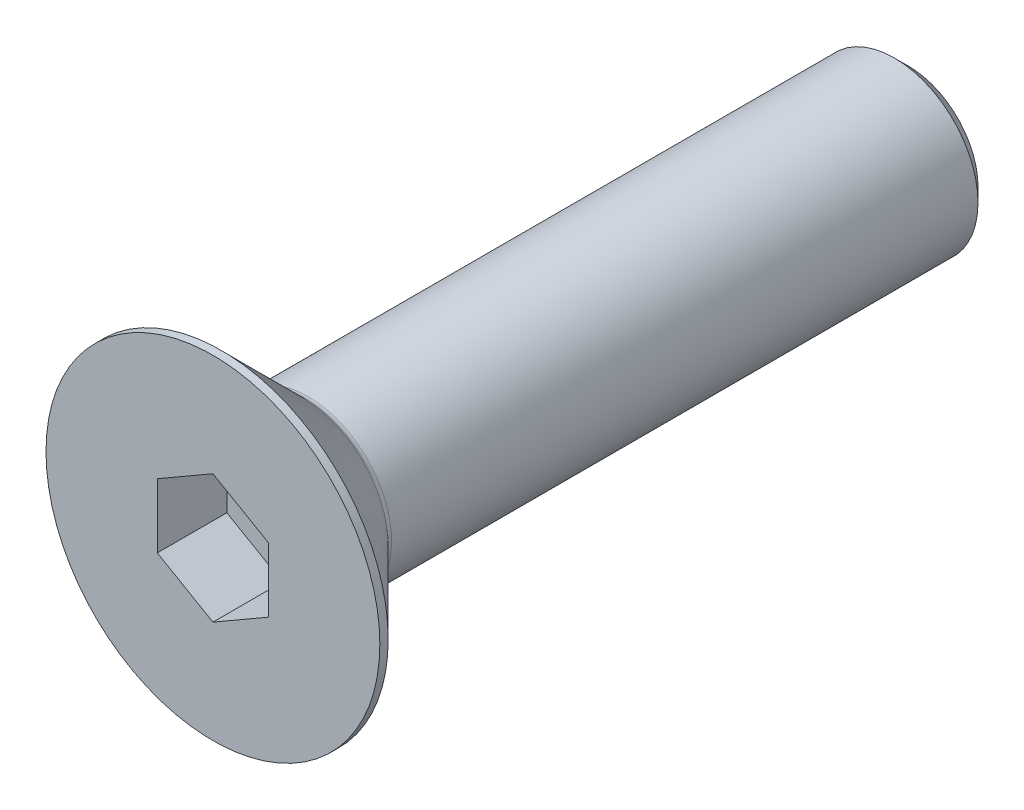
ISO-10303-21;
HEADER;
FILE_DESCRIPTION(('STEP AP214'),'2;1');
FILE_NAME('part.step','',(''),(''),'','','');
FILE_SCHEMA(('AUTOMOTIVE_DESIGN { 1 0 10303 214 1 1 1 1 }'));
ENDSEC;
DATA;
#1=APPLICATION_CONTEXT('core data for automotive mechanical design processes');
#2=APPLICATION_PROTOCOL_DEFINITION('international standard','automotive_design',2000,#1);
#3=PRODUCT_CONTEXT('',#1,'mechanical');
#4=PRODUCT('Part','Part','',(#3));
#5=PRODUCT_RELATED_PRODUCT_CATEGORY('part','',(#4));
#6=PRODUCT_DEFINITION_FORMATION('','',#4);
#7=PRODUCT_DEFINITION_CONTEXT('part definition',#1,'design');
#8=PRODUCT_DEFINITION('design','',#6,#7);
#9=PRODUCT_DEFINITION_SHAPE('','',#8);
#10=(LENGTH_UNIT() NAMED_UNIT(*) SI_UNIT(.MILLI.,.METRE.));
#11=(NAMED_UNIT(*) PLANE_ANGLE_UNIT() SI_UNIT($,.RADIAN.));
#12=(NAMED_UNIT(*) SI_UNIT($,.STERADIAN.) SOLID_ANGLE_UNIT());
#13=UNCERTAINTY_MEASURE_WITH_UNIT(LENGTH_MEASURE(1.E-05),#10,'distance_accuracy_value','');
#14=(GEOMETRIC_REPRESENTATION_CONTEXT(3) GLOBAL_UNCERTAINTY_ASSIGNED_CONTEXT((#13)) GLOBAL_UNIT_ASSIGNED_CONTEXT((#10,
#11,#12)) REPRESENTATION_CONTEXT('',''));
#15=CARTESIAN_POINT('',(0.,0.,0.));
#16=DIRECTION('',(0.,0.,1.));
#17=DIRECTION('',(1.,0.,0.));
#18=AXIS2_PLACEMENT_3D('',#15,#16,#17);
#19=CARTESIAN_POINT('',(0.,0.,-2.5));
#20=DIRECTION('',(0.,0.,1.));
#21=DIRECTION('',(1.,0.,0.));
#22=AXIS2_PLACEMENT_3D('',#19,#20,#21);
#23=PLANE('',#22);
#24=DIRECTION('',(-0.866025403784439,-0.5,0.));
#25=VECTOR('',#24,1.);
#26=CARTESIAN_POINT('',(0.,2.3094010767585,-2.5));
#27=LINE('',#26,#25);
#28=CARTESIAN_POINT('',(0.,2.3094010767585,-2.5));
#29=VERTEX_POINT('',#28);
#30=CARTESIAN_POINT('',(-2.,1.15470053837925,-2.5));
#31=VERTEX_POINT('',#30);
#32=EDGE_CURVE('E81',#29,#31,#27,.T.);
#33=ORIENTED_EDGE('',*,*,#32,.T.);
#34=DIRECTION('',(0.,1.,0.));
#35=VECTOR('',#34,1.);
#36=CARTESIAN_POINT('',(-2.,1.15470053837925,-2.5));
#37=LINE('',#36,#35);
#38=CARTESIAN_POINT('',(-2.,-1.15470053837925,-2.5));
#39=VERTEX_POINT('',#38);
#40=EDGE_CURVE('E65',#31,#39,#37,.F.);
#41=ORIENTED_EDGE('',*,*,#40,.T.);
#42=DIRECTION('',(0.866025403784439,-0.499999999999999,0.));
#43=VECTOR('',#42,1.);
#44=CARTESIAN_POINT('',(-2.,-1.15470053837925,-2.5));
#45=LINE('',#44,#43);
#46=CARTESIAN_POINT('',(0.,-2.3094010767585,-2.5));
#47=VERTEX_POINT('',#46);
#48=EDGE_CURVE('E70',#39,#47,#45,.T.);
#49=ORIENTED_EDGE('',*,*,#48,.T.);
#50=DIRECTION('',(0.866025403784439,0.5,0.));
#51=VECTOR('',#50,1.);
#52=CARTESIAN_POINT('',(0.,-2.3094010767585,-2.5));
#53=LINE('',#52,#51);
#54=CARTESIAN_POINT('',(2.,-1.15470053837925,-2.5));
#55=VERTEX_POINT('',#54);
#56=EDGE_CURVE('E127',#47,#55,#53,.T.);
#57=ORIENTED_EDGE('',*,*,#56,.T.);
#58=DIRECTION('',(0.,1.,0.));
#59=VECTOR('',#58,1.);
#60=CARTESIAN_POINT('',(2.,-1.15470053837925,-2.5));
#61=LINE('',#60,#59);
#62=CARTESIAN_POINT('',(2.,1.15470053837925,-2.5));
#63=VERTEX_POINT('',#62);
#64=EDGE_CURVE('E131',#55,#63,#61,.T.);
#65=ORIENTED_EDGE('',*,*,#64,.T.);
#66=DIRECTION('',(-0.866025403784439,0.499999999999999,0.));
#67=VECTOR('',#66,1.);
#68=CARTESIAN_POINT('',(2.,1.15470053837925,-2.5));
#69=LINE('',#68,#67);
#70=EDGE_CURVE('E136',#63,#29,#69,.T.);
#71=ORIENTED_EDGE('',*,*,#70,.T.);
#72=EDGE_LOOP('',(#33,#41,#49,#57,#65,#71));
#73=FACE_BOUND('',#72,.T.);
#74=ADVANCED_FACE('F14',(#73),#23,.T.);
#75=CARTESIAN_POINT('',(-2.,-1.15470053837925,0.));
#76=DIRECTION('',(-0.499999999999999,-0.866025403784439,0.));
#77=DIRECTION('',(0.866025403784439,-0.499999999999999,0.));
#78=AXIS2_PLACEMENT_3D('',#75,#76,#77);
#79=PLANE('',#78);
#80=DIRECTION('',(0.,0.,1.));
#81=VECTOR('',#80,1.);
#82=CARTESIAN_POINT('',(-2.,-1.15470053837925,0.));
#83=LINE('',#82,#81);
#84=CARTESIAN_POINT('',(-2.,-1.15470053837925,0.));
#85=VERTEX_POINT('',#84);
#86=EDGE_CURVE('E72',#39,#85,#83,.T.);
#87=ORIENTED_EDGE('',*,*,#86,.T.);
#88=DIRECTION('',(-0.866025403784439,0.499999999999999,0.));
#89=VECTOR('',#88,1.);
#90=CARTESIAN_POINT('',(0.,-2.3094010767585,0.));
#91=LINE('',#90,#89);
#92=CARTESIAN_POINT('',(0.,-2.3094010767585,0.));
#93=VERTEX_POINT('',#92);
#94=EDGE_CURVE('E125',#93,#85,#91,.T.);
#95=ORIENTED_EDGE('',*,*,#94,.F.);
#96=DIRECTION('',(0.,0.,1.));
#97=VECTOR('',#96,1.);
#98=CARTESIAN_POINT('',(0.,-2.3094010767585,0.));
#99=LINE('',#98,#97);
#100=EDGE_CURVE('E75',#93,#47,#99,.F.);
#101=ORIENTED_EDGE('',*,*,#100,.T.);
#102=ORIENTED_EDGE('',*,*,#48,.F.);
#103=EDGE_LOOP('',(#87,#95,#101,#102));
#104=FACE_BOUND('',#103,.T.);
#105=ADVANCED_FACE('F71',(#104),#79,.F.);
#106=CARTESIAN_POINT('',(-2.,1.15470053837925,0.));
#107=DIRECTION('',(-1.,0.,0.));
#108=DIRECTION('',(0.,0.,1.));
#109=AXIS2_PLACEMENT_3D('',#106,#107,#108);
#110=PLANE('',#109);
#111=DIRECTION('',(0.,0.,1.));
#112=VECTOR('',#111,1.);
#113=CARTESIAN_POINT('',(-2.,1.15470053837925,0.));
#114=LINE('',#113,#112);
#115=CARTESIAN_POINT('',(-2.,1.15470053837925,0.));
#116=VERTEX_POINT('',#115);
#117=EDGE_CURVE('E83',#31,#116,#114,.T.);
#118=ORIENTED_EDGE('',*,*,#117,.T.);
#119=DIRECTION('',(0.,1.,0.));
#120=VECTOR('',#119,1.);
#121=CARTESIAN_POINT('',(-2.,0.,0.));
#122=LINE('',#121,#120);
#123=EDGE_CURVE('E87',#85,#116,#122,.T.);
#124=ORIENTED_EDGE('',*,*,#123,.F.);
#125=ORIENTED_EDGE('',*,*,#86,.F.);
#126=ORIENTED_EDGE('',*,*,#40,.F.);
#127=EDGE_LOOP('',(#118,#124,#125,#126));
#128=FACE_BOUND('',#127,.T.);
#129=ADVANCED_FACE('F85',(#128),#110,.F.);
#130=CARTESIAN_POINT('',(0.,2.3094010767585,0.));
#131=DIRECTION('',(-0.5,0.866025403784439,0.));
#132=DIRECTION('',(-0.866025403784439,-0.5,0.));
#133=AXIS2_PLACEMENT_3D('',#130,#131,#132);
#134=PLANE('',#133);
#135=DIRECTION('',(0.,0.,1.));
#136=VECTOR('',#135,1.);
#137=CARTESIAN_POINT('',(0.,2.3094010767585,0.));
#138=LINE('',#137,#136);
#139=CARTESIAN_POINT('',(0.,2.3094010767585,0.));
#140=VERTEX_POINT('',#139);
#141=EDGE_CURVE('E138',#29,#140,#138,.T.);
#142=ORIENTED_EDGE('',*,*,#141,.T.);
#143=DIRECTION('',(0.866025403784439,0.5,0.));
#144=VECTOR('',#143,1.);
#145=CARTESIAN_POINT('',(-2.,1.15470053837925,0.));
#146=LINE('',#145,#144);
#147=EDGE_CURVE('E121',#116,#140,#146,.T.);
#148=ORIENTED_EDGE('',*,*,#147,.F.);
#149=ORIENTED_EDGE('',*,*,#117,.F.);
#150=ORIENTED_EDGE('',*,*,#32,.F.);
#151=EDGE_LOOP('',(#142,#148,#149,#150));
#152=FACE_BOUND('',#151,.T.);
#153=ADVANCED_FACE('F142',(#152),#134,.F.);
#154=CARTESIAN_POINT('',(2.,1.15470053837925,0.));
#155=DIRECTION('',(0.499999999999999,0.866025403784439,0.));
#156=DIRECTION('',(-0.866025403784439,0.499999999999999,0.));
#157=AXIS2_PLACEMENT_3D('',#154,#155,#156);
#158=PLANE('',#157);
#159=DIRECTION('',(0.,0.,-1.));
#160=VECTOR('',#159,1.);
#161=CARTESIAN_POINT('',(2.,1.15470053837925,0.));
#162=LINE('',#161,#160);
#163=CARTESIAN_POINT('',(2.,1.15470053837925,0.));
#164=VERTEX_POINT('',#163);
#165=EDGE_CURVE('E134',#63,#164,#162,.F.);
#166=ORIENTED_EDGE('',*,*,#165,.T.);
#167=DIRECTION('',(0.866025403784439,-0.499999999999999,0.));
#168=VECTOR('',#167,1.);
#169=CARTESIAN_POINT('',(0.,2.3094010767585,0.));
#170=LINE('',#169,#168);
#171=EDGE_CURVE('E118',#140,#164,#170,.T.);
#172=ORIENTED_EDGE('',*,*,#171,.F.);
#173=ORIENTED_EDGE('',*,*,#141,.F.);
#174=ORIENTED_EDGE('',*,*,#70,.F.);
#175=EDGE_LOOP('',(#166,#172,#173,#174));
#176=FACE_BOUND('',#175,.T.);
#177=ADVANCED_FACE('F153',(#176),#158,.F.);
#178=CARTESIAN_POINT('',(2.,-1.15470053837925,0.));
#179=DIRECTION('',(1.,0.,0.));
#180=DIRECTION('',(0.,0.,-1.));
#181=AXIS2_PLACEMENT_3D('',#178,#179,#180);
#182=PLANE('',#181);
#183=DIRECTION('',(0.,0.,1.));
#184=VECTOR('',#183,1.);
#185=CARTESIAN_POINT('',(2.,-1.15470053837925,0.));
#186=LINE('',#185,#184);
#187=CARTESIAN_POINT('',(2.,-1.15470053837925,0.));
#188=VERTEX_POINT('',#187);
#189=EDGE_CURVE('E33',#55,#188,#186,.T.);
#190=ORIENTED_EDGE('',*,*,#189,.T.);
#191=DIRECTION('',(0.,1.,0.));
#192=VECTOR('',#191,1.);
#193=CARTESIAN_POINT('',(2.,0.,0.));
#194=LINE('',#193,#192);
#195=EDGE_CURVE('E115',#164,#188,#194,.F.);
#196=ORIENTED_EDGE('',*,*,#195,.F.);
#197=ORIENTED_EDGE('',*,*,#165,.F.);
#198=ORIENTED_EDGE('',*,*,#64,.F.);
#199=EDGE_LOOP('',(#190,#196,#197,#198));
#200=FACE_BOUND('',#199,.T.);
#201=ADVANCED_FACE('F151',(#200),#182,.F.);
#202=CARTESIAN_POINT('',(0.,-2.3094010767585,0.));
#203=DIRECTION('',(0.5,-0.866025403784439,0.));
#204=DIRECTION('',(0.866025403784439,0.5,0.));
#205=AXIS2_PLACEMENT_3D('',#202,#203,#204);
#206=PLANE('',#205);
#207=ORIENTED_EDGE('',*,*,#100,.F.);
#208=DIRECTION('',(-0.866025403784439,-0.5,0.));
#209=VECTOR('',#208,1.);
#210=CARTESIAN_POINT('',(2.,-1.15470053837925,0.));
#211=LINE('',#210,#209);
#212=EDGE_CURVE('E112',#188,#93,#211,.T.);
#213=ORIENTED_EDGE('',*,*,#212,.F.);
#214=ORIENTED_EDGE('',*,*,#189,.F.);
#215=ORIENTED_EDGE('',*,*,#56,.F.);
#216=EDGE_LOOP('',(#207,#213,#214,#215));
#217=FACE_BOUND('',#216,.T.);
#218=ADVANCED_FACE('F149',(#217),#206,.F.);
#219=CARTESIAN_POINT('',(3.,0.,0.));
#220=DIRECTION('',(0.,0.,1.));
#221=DIRECTION('',(1.,0.,0.));
#222=AXIS2_PLACEMENT_3D('',#219,#220,#221);
#223=PLANE('',#222);
#224=ORIENTED_EDGE('',*,*,#195,.T.);
#225=ORIENTED_EDGE('',*,*,#212,.T.);
#226=ORIENTED_EDGE('',*,*,#94,.T.);
#227=ORIENTED_EDGE('',*,*,#123,.T.);
#228=ORIENTED_EDGE('',*,*,#147,.T.);
#229=ORIENTED_EDGE('',*,*,#171,.T.);
#230=EDGE_LOOP('',(#224,#225,#226,#227,#228,#229));
#231=FACE_BOUND('',#230,.T.);
#232=CARTESIAN_POINT('',(0.,0.,0.));
#233=DIRECTION('',(0.,0.,-1.));
#234=DIRECTION('',(-1.,0.,0.));
#235=AXIS2_PLACEMENT_3D('',#232,#233,#234);
#236=CIRCLE('',#235,6.);
#237=CARTESIAN_POINT('',(-6.,0.,0.));
#238=VERTEX_POINT('',#237);
#239=EDGE_CURVE('E18',#238,#238,#236,.T.);
#240=ORIENTED_EDGE('',*,*,#239,.F.);
#241=EDGE_LOOP('',(#240));
#242=FACE_BOUND('',#241,.T.);
#243=ADVANCED_FACE('F146',(#231,#242),#223,.T.);
#244=CARTESIAN_POINT('',(0.,0.,-0.150000000000001));
#245=DIRECTION('',(0.,0.,-1.));
#246=DIRECTION('',(-1.,0.,0.));
#247=AXIS2_PLACEMENT_3D('',#244,#245,#246);
#248=CYLINDRICAL_SURFACE('',#247,6.);
#249=ORIENTED_EDGE('',*,*,#239,.T.);
#250=EDGE_LOOP('',(#249));
#251=FACE_BOUND('',#250,.T.);
#252=CARTESIAN_POINT('',(0.,0.,-0.299999998617295));
#253=DIRECTION('',(0.,0.,1.));
#254=DIRECTION('',(1.,0.,0.));
#255=AXIS2_PLACEMENT_3D('',#252,#253,#254);
#256=CIRCLE('',#255,5.99999999872125);
#257=CARTESIAN_POINT('',(5.99999999872125,0.,-0.299999998617295));
#258=VERTEX_POINT('',#257);
#259=EDGE_CURVE('E99',#258,#258,#256,.F.);
#260=ORIENTED_EDGE('',*,*,#259,.F.);
#261=EDGE_LOOP('',(#260));
#262=FACE_BOUND('',#261,.T.);
#263=ADVANCED_FACE('F182',(#251,#262),#248,.T.);
#264=CARTESIAN_POINT('',(0.,0.,-0.299999998617295));
#265=DIRECTION('',(0.,0.,1.));
#266=DIRECTION('',(1.,0.,0.));
#267=AXIS2_PLACEMENT_3D('',#264,#265,#266);
#268=CONICAL_SURFACE('',#267,5.99999999872125,0.78539816249955);
#269=CARTESIAN_POINT('',(0.,0.,-3.21213203435597));
#270=DIRECTION('',(0.,0.,-1.));
#271=DIRECTION('',(-1.,0.,0.));
#272=AXIS2_PLACEMENT_3D('',#269,#270,#271);
#273=CIRCLE('',#272,3.08786796564404);
#274=CARTESIAN_POINT('',(-3.08786796564404,0.,-3.21213203435597));
#275=VERTEX_POINT('',#274);
#276=EDGE_CURVE('E93',#275,#275,#273,.T.);
#277=ORIENTED_EDGE('',*,*,#276,.F.);
#278=EDGE_LOOP('',(#277));
#279=FACE_BOUND('',#278,.T.);
#280=ORIENTED_EDGE('',*,*,#259,.T.);
#281=EDGE_LOOP('',(#280));
#282=FACE_BOUND('',#281,.T.);
#283=ADVANCED_FACE('F178',(#279,#282),#268,.T.);
#284=CARTESIAN_POINT('',(1.5,0.,-25.));
#285=DIRECTION('',(0.,0.,-1.));
#286=DIRECTION('',(-1.,0.,0.));
#287=AXIS2_PLACEMENT_3D('',#284,#285,#286);
#288=PLANE('',#287);
#289=CARTESIAN_POINT('',(0.,0.,-25.0000000002046));
#290=DIRECTION('',(0.,0.,1.));
#291=DIRECTION('',(1.,0.,0.));
#292=AXIS2_PLACEMENT_3D('',#289,#290,#291);
#293=CIRCLE('',#292,2.50000000016826);
#294=CARTESIAN_POINT('',(2.50000000016826,0.,-25.0000000002046));
#295=VERTEX_POINT('',#294);
#296=EDGE_CURVE('E91',#295,#295,#293,.T.);
#297=ORIENTED_EDGE('',*,*,#296,.F.);
#298=EDGE_LOOP('',(#297));
#299=FACE_BOUND('',#298,.T.);
#300=ADVANCED_FACE('F175',(#299),#288,.T.);
#301=CARTESIAN_POINT('',(0.,0.,-3.42426406871193));
#302=DIRECTION('',(0.,0.,-1.));
#303=DIRECTION('',(-1.,0.,0.));
#304=AXIS2_PLACEMENT_3D('',#301,#302,#303);
#305=TOROIDAL_SURFACE('',#304,3.3,0.3);
#306=CARTESIAN_POINT('',(0.,0.,-3.42426406871193));
#307=DIRECTION('',(0.,0.,-1.));
#308=DIRECTION('',(-1.,0.,0.));
#309=AXIS2_PLACEMENT_3D('',#306,#307,#308);
#310=CIRCLE('',#309,3.);
#311=CARTESIAN_POINT('',(-3.,0.,-3.42426406871193));
#312=VERTEX_POINT('',#311);
#313=EDGE_CURVE('E24',#312,#312,#310,.T.);
#314=ORIENTED_EDGE('',*,*,#313,.F.);
#315=EDGE_LOOP('',(#314));
#316=FACE_BOUND('',#315,.T.);
#317=ORIENTED_EDGE('',*,*,#276,.T.);
#318=EDGE_LOOP('',(#317));
#319=FACE_BOUND('',#318,.T.);
#320=ADVANCED_FACE('F16',(#316,#319),#305,.F.);
#321=CARTESIAN_POINT('',(0.,0.,-24.4999999998186));
#322=DIRECTION('',(0.,0.,1.));
#323=DIRECTION('',(1.,0.,0.));
#324=AXIS2_PLACEMENT_3D('',#321,#322,#323);
#325=CONICAL_SURFACE('',#324,2.99999999970169,0.785398162544797);
#326=ORIENTED_EDGE('',*,*,#296,.T.);
#327=EDGE_LOOP('',(#326));
#328=FACE_BOUND('',#327,.T.);
#329=CARTESIAN_POINT('',(0.,0.,-24.5));
#330=DIRECTION('',(0.,0.,-1.));
#331=DIRECTION('',(-1.,0.,0.));
#332=AXIS2_PLACEMENT_3D('',#329,#330,#331);
#333=CIRCLE('',#332,3.);
#334=CARTESIAN_POINT('',(-3.,0.,-24.5));
#335=VERTEX_POINT('',#334);
#336=EDGE_CURVE('E9',#335,#335,#333,.F.);
#337=ORIENTED_EDGE('',*,*,#336,.F.);
#338=EDGE_LOOP('',(#337));
#339=FACE_BOUND('',#338,.T.);
#340=ADVANCED_FACE('F165',(#328,#339),#325,.T.);
#341=CARTESIAN_POINT('',(0.,0.,-14.15));
#342=DIRECTION('',(0.,0.,-1.));
#343=DIRECTION('',(-1.,0.,0.));
#344=AXIS2_PLACEMENT_3D('',#341,#342,#343);
#345=CYLINDRICAL_SURFACE('',#344,3.);
#346=ORIENTED_EDGE('',*,*,#336,.T.);
#347=EDGE_LOOP('',(#346));
#348=FACE_BOUND('',#347,.T.);
#349=ORIENTED_EDGE('',*,*,#313,.T.);
#350=EDGE_LOOP('',(#349));
#351=FACE_BOUND('',#350,.T.);
#352=ADVANCED_FACE('F163',(#348,#351),#345,.T.);
#353=CLOSED_SHELL('',(#74,#105,#129,#153,#177,#201,#218,#243,#263,#283,#300,#320,#340,#352));
#354=MANIFOLD_SOLID_BREP('B1',#353);
#355=ADVANCED_BREP_SHAPE_REPRESENTATION('',(#18,#354),#14);
#356=SHAPE_DEFINITION_REPRESENTATION(#9,#355);
ENDSEC;
END-ISO-10303-21;
